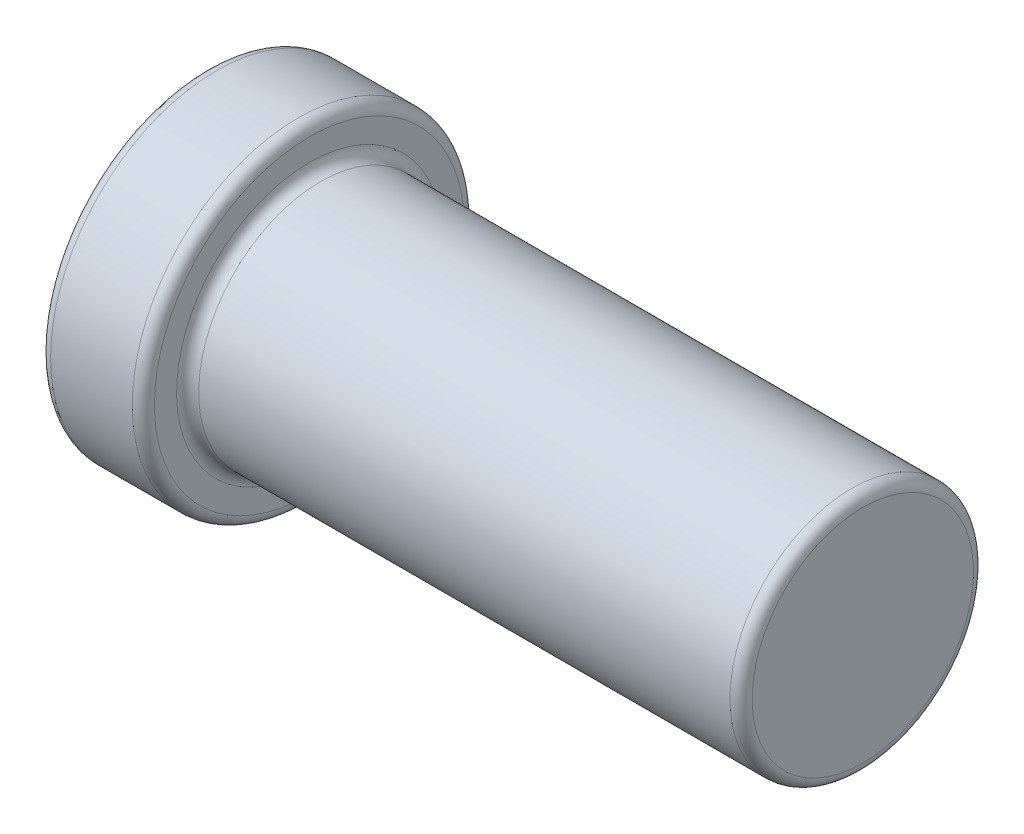
ISO-10303-21;
HEADER;
FILE_DESCRIPTION(('STEP AP214'),'2;1');
FILE_NAME('part.step','',(''),(''),'','','');
FILE_SCHEMA(('AUTOMOTIVE_DESIGN { 1 0 10303 214 1 1 1 1 }'));
ENDSEC;
DATA;
#1=APPLICATION_CONTEXT('core data for automotive mechanical design processes');
#2=APPLICATION_PROTOCOL_DEFINITION('international standard','automotive_design',2000,#1);
#3=PRODUCT_CONTEXT('',#1,'mechanical');
#4=PRODUCT('Part','Part','',(#3));
#5=PRODUCT_RELATED_PRODUCT_CATEGORY('part','',(#4));
#6=PRODUCT_DEFINITION_FORMATION('','',#4);
#7=PRODUCT_DEFINITION_CONTEXT('part definition',#1,'design');
#8=PRODUCT_DEFINITION('design','',#6,#7);
#9=PRODUCT_DEFINITION_SHAPE('','',#8);
#10=(LENGTH_UNIT() NAMED_UNIT(*) SI_UNIT(.MILLI.,.METRE.));
#11=(NAMED_UNIT(*) PLANE_ANGLE_UNIT() SI_UNIT($,.RADIAN.));
#12=(NAMED_UNIT(*) SI_UNIT($,.STERADIAN.) SOLID_ANGLE_UNIT());
#13=UNCERTAINTY_MEASURE_WITH_UNIT(LENGTH_MEASURE(1.E-05),#10,'distance_accuracy_value','');
#14=(GEOMETRIC_REPRESENTATION_CONTEXT(3) GLOBAL_UNCERTAINTY_ASSIGNED_CONTEXT((#13)) GLOBAL_UNIT_ASSIGNED_CONTEXT((#10,
#11,#12)) REPRESENTATION_CONTEXT('',''));
#15=CARTESIAN_POINT('',(0.,0.,0.));
#16=DIRECTION('',(0.,0.,1.));
#17=DIRECTION('',(1.,0.,0.));
#18=AXIS2_PLACEMENT_3D('',#15,#16,#17);
#19=CARTESIAN_POINT('',(0.,0.,0.));
#20=DIRECTION('',(-1.,0.,0.));
#21=DIRECTION('',(0.,-1.,0.));
#22=AXIS2_PLACEMENT_3D('',#19,#20,#21);
#23=CONICAL_SURFACE('',#22,1.5,1.10714871779409);
#24=CARTESIAN_POINT('',(0.489442719099992,0.,0.));
#25=DIRECTION('',(-1.,0.,0.));
#26=DIRECTION('',(0.,-1.,0.));
#27=AXIS2_PLACEMENT_3D('',#24,#25,#26);
#28=CIRCLE('',#27,0.521114561800017);
#29=CARTESIAN_POINT('',(0.489442719099992,-0.521114561800017,0.));
#30=VERTEX_POINT('',#29);
#31=EDGE_CURVE('E38',#30,#30,#28,.F.);
#32=ORIENTED_EDGE('',*,*,#31,.T.);
#33=EDGE_LOOP('',(#32));
#34=FACE_BOUND('',#33,.T.);
#35=CARTESIAN_POINT('',(0.0723606797749982,0.,0.));
#36=DIRECTION('',(1.,0.,0.));
#37=DIRECTION('',(0.,1.,0.));
#38=AXIS2_PLACEMENT_3D('',#35,#36,#37);
#39=CIRCLE('',#38,1.35527864045);
#40=CARTESIAN_POINT('',(0.0723606797749981,1.35527864045,0.));
#41=VERTEX_POINT('',#40);
#42=EDGE_CURVE('E42',#41,#41,#39,.F.);
#43=ORIENTED_EDGE('',*,*,#42,.T.);
#44=EDGE_LOOP('',(#43));
#45=FACE_BOUND('',#44,.T.);
#46=ADVANCED_FACE('F31',(#34,#45),#23,.F.);
#47=CARTESIAN_POINT('',(6.,0.,0.));
#48=DIRECTION('',(1.,0.,0.));
#49=DIRECTION('',(0.,1.,0.));
#50=AXIS2_PLACEMENT_3D('',#47,#48,#49);
#51=CYLINDRICAL_SURFACE('',#50,1.5);
#52=CARTESIAN_POINT('',(0.9,0.,0.));
#53=DIRECTION('',(1.,0.,0.));
#54=DIRECTION('',(0.,1.,0.));
#55=AXIS2_PLACEMENT_3D('',#52,#53,#54);
#56=CIRCLE('',#55,1.5);
#57=CARTESIAN_POINT('',(0.9,1.5,0.));
#58=VERTEX_POINT('',#57);
#59=EDGE_CURVE('E46',#58,#58,#56,.F.);
#60=ORIENTED_EDGE('',*,*,#59,.T.);
#61=EDGE_LOOP('',(#60));
#62=FACE_BOUND('',#61,.T.);
#63=CARTESIAN_POINT('',(0.16180339887499,0.,0.));
#64=DIRECTION('',(-1.,0.,0.));
#65=DIRECTION('',(0.,-1.,0.));
#66=AXIS2_PLACEMENT_3D('',#63,#64,#65);
#67=CIRCLE('',#66,1.5);
#68=CARTESIAN_POINT('',(0.16180339887499,-1.5,0.));
#69=VERTEX_POINT('',#68);
#70=EDGE_CURVE('E51',#69,#69,#67,.F.);
#71=ORIENTED_EDGE('',*,*,#70,.T.);
#72=EDGE_LOOP('',(#71));
#73=FACE_BOUND('',#72,.T.);
#74=ADVANCED_FACE('F90',(#62,#73),#51,.T.);
#75=CARTESIAN_POINT('',(1.,1.5,0.));
#76=DIRECTION('',(1.,0.,0.));
#77=DIRECTION('',(0.,1.,0.));
#78=AXIS2_PLACEMENT_3D('',#75,#76,#77);
#79=PLANE('',#78);
#80=CARTESIAN_POINT('',(1.,0.,0.));
#81=DIRECTION('',(1.,0.,0.));
#82=DIRECTION('',(0.,1.,0.));
#83=AXIS2_PLACEMENT_3D('',#80,#81,#82);
#84=CIRCLE('',#83,1.2);
#85=CARTESIAN_POINT('',(1.,1.2,0.));
#86=VERTEX_POINT('',#85);
#87=EDGE_CURVE('E54',#86,#86,#84,.F.);
#88=ORIENTED_EDGE('',*,*,#87,.T.);
#89=EDGE_LOOP('',(#88));
#90=FACE_BOUND('',#89,.T.);
#91=CARTESIAN_POINT('',(1.,0.,0.));
#92=DIRECTION('',(1.,0.,0.));
#93=DIRECTION('',(0.,1.,0.));
#94=AXIS2_PLACEMENT_3D('',#91,#92,#93);
#95=CIRCLE('',#94,1.4);
#96=CARTESIAN_POINT('',(1.,1.4,0.));
#97=VERTEX_POINT('',#96);
#98=EDGE_CURVE('E57',#97,#97,#95,.T.);
#99=ORIENTED_EDGE('',*,*,#98,.T.);
#100=EDGE_LOOP('',(#99));
#101=FACE_BOUND('',#100,.T.);
#102=ADVANCED_FACE('F94',(#90,#101),#79,.T.);
#103=CARTESIAN_POINT('',(6.,0.,0.));
#104=DIRECTION('',(1.,0.,0.));
#105=DIRECTION('',(0.,1.,0.));
#106=AXIS2_PLACEMENT_3D('',#103,#104,#105);
#107=CYLINDRICAL_SURFACE('',#106,1.1);
#108=CARTESIAN_POINT('',(1.1,0.,0.));
#109=DIRECTION('',(1.,0.,0.));
#110=DIRECTION('',(0.,1.,0.));
#111=AXIS2_PLACEMENT_3D('',#108,#109,#110);
#112=CIRCLE('',#111,1.1);
#113=CARTESIAN_POINT('',(1.1,1.1,0.));
#114=VERTEX_POINT('',#113);
#115=EDGE_CURVE('E60',#114,#114,#112,.T.);
#116=ORIENTED_EDGE('',*,*,#115,.T.);
#117=EDGE_LOOP('',(#116));
#118=FACE_BOUND('',#117,.T.);
#119=CARTESIAN_POINT('',(5.9,0.,0.));
#120=DIRECTION('',(1.,0.,0.));
#121=DIRECTION('',(0.,1.,0.));
#122=AXIS2_PLACEMENT_3D('',#119,#120,#121);
#123=CIRCLE('',#122,1.1);
#124=CARTESIAN_POINT('',(5.9,1.1,0.));
#125=VERTEX_POINT('',#124);
#126=EDGE_CURVE('E63',#125,#125,#123,.F.);
#127=ORIENTED_EDGE('',*,*,#126,.T.);
#128=EDGE_LOOP('',(#127));
#129=FACE_BOUND('',#128,.T.);
#130=ADVANCED_FACE('F101',(#118,#129),#107,.T.);
#131=CARTESIAN_POINT('',(6.,1.1,0.));
#132=DIRECTION('',(1.,0.,0.));
#133=DIRECTION('',(0.,1.,0.));
#134=AXIS2_PLACEMENT_3D('',#131,#132,#133);
#135=PLANE('',#134);
#136=CARTESIAN_POINT('',(6.,0.,0.));
#137=DIRECTION('',(1.,0.,0.));
#138=DIRECTION('',(0.,1.,0.));
#139=AXIS2_PLACEMENT_3D('',#136,#137,#138);
#140=CIRCLE('',#139,1.);
#141=CARTESIAN_POINT('',(6.,1.,0.));
#142=VERTEX_POINT('',#141);
#143=EDGE_CURVE('E66',#142,#142,#140,.T.);
#144=ORIENTED_EDGE('',*,*,#143,.T.);
#145=EDGE_LOOP('',(#144));
#146=FACE_BOUND('',#145,.T.);
#147=ADVANCED_FACE('F70',(#146),#135,.T.);
#148=CARTESIAN_POINT('',(0.5,0.,0.));
#149=DIRECTION('',(-1.,0.,0.));
#150=DIRECTION('',(0.,-1.,0.));
#151=AXIS2_PLACEMENT_3D('',#148,#149,#150);
#152=PLANE('',#151);
#153=CARTESIAN_POINT('',(0.5,0.,0.));
#154=DIRECTION('',(-1.,0.,0.));
#155=DIRECTION('',(0.,-1.,0.));
#156=AXIS2_PLACEMENT_3D('',#153,#154,#155);
#157=CIRCLE('',#156,0.476393202250021);
#158=CARTESIAN_POINT('',(0.5,-0.476393202250021,0.));
#159=VERTEX_POINT('',#158);
#160=EDGE_CURVE('E10',#159,#159,#157,.T.);
#161=ORIENTED_EDGE('',*,*,#160,.T.);
#162=EDGE_LOOP('',(#161));
#163=FACE_BOUND('',#162,.T.);
#164=ADVANCED_FACE('F75',(#163),#152,.T.);
#165=CARTESIAN_POINT('',(5.9,0.,0.));
#166=DIRECTION('',(1.,0.,0.));
#167=DIRECTION('',(0.,1.,0.));
#168=AXIS2_PLACEMENT_3D('',#165,#166,#167);
#169=TOROIDAL_SURFACE('',#168,1.,0.1);
#170=ORIENTED_EDGE('',*,*,#126,.F.);
#171=EDGE_LOOP('',(#170));
#172=FACE_BOUND('',#171,.T.);
#173=ORIENTED_EDGE('',*,*,#143,.F.);
#174=EDGE_LOOP('',(#173));
#175=FACE_BOUND('',#174,.T.);
#176=ADVANCED_FACE('F72',(#172,#175),#169,.T.);
#177=CARTESIAN_POINT('',(1.1,0.,0.));
#178=DIRECTION('',(1.,0.,0.));
#179=DIRECTION('',(0.,1.,0.));
#180=AXIS2_PLACEMENT_3D('',#177,#178,#179);
#181=TOROIDAL_SURFACE('',#180,1.2,0.1);
#182=ORIENTED_EDGE('',*,*,#87,.F.);
#183=EDGE_LOOP('',(#182));
#184=FACE_BOUND('',#183,.T.);
#185=ORIENTED_EDGE('',*,*,#115,.F.);
#186=EDGE_LOOP('',(#185));
#187=FACE_BOUND('',#186,.T.);
#188=ADVANCED_FACE('F74',(#184,#187),#181,.F.);
#189=CARTESIAN_POINT('',(0.9,0.,0.));
#190=DIRECTION('',(1.,0.,0.));
#191=DIRECTION('',(0.,1.,0.));
#192=AXIS2_PLACEMENT_3D('',#189,#190,#191);
#193=TOROIDAL_SURFACE('',#192,1.4,0.1);
#194=ORIENTED_EDGE('',*,*,#59,.F.);
#195=EDGE_LOOP('',(#194));
#196=FACE_BOUND('',#195,.T.);
#197=ORIENTED_EDGE('',*,*,#98,.F.);
#198=EDGE_LOOP('',(#197));
#199=FACE_BOUND('',#198,.T.);
#200=ADVANCED_FACE('F82',(#196,#199),#193,.T.);
#201=CARTESIAN_POINT('',(0.4,0.,0.));
#202=DIRECTION('',(-1.,0.,0.));
#203=DIRECTION('',(0.,-1.,0.));
#204=AXIS2_PLACEMENT_3D('',#201,#202,#203);
#205=TOROIDAL_SURFACE('',#204,0.476393202250021,0.1);
#206=ORIENTED_EDGE('',*,*,#160,.F.);
#207=EDGE_LOOP('',(#206));
#208=FACE_BOUND('',#207,.T.);
#209=ORIENTED_EDGE('',*,*,#31,.F.);
#210=EDGE_LOOP('',(#209));
#211=FACE_BOUND('',#210,.T.);
#212=ADVANCED_FACE('F133',(#208,#211),#205,.F.);
#213=CARTESIAN_POINT('',(0.16180339887499,0.,0.));
#214=DIRECTION('',(-1.,0.,0.));
#215=DIRECTION('',(0.,-1.,0.));
#216=AXIS2_PLACEMENT_3D('',#213,#214,#215);
#217=TOROIDAL_SURFACE('',#216,1.4,0.1);
#218=ORIENTED_EDGE('',*,*,#42,.F.);
#219=EDGE_LOOP('',(#218));
#220=FACE_BOUND('',#219,.T.);
#221=ORIENTED_EDGE('',*,*,#70,.F.);
#222=EDGE_LOOP('',(#221));
#223=FACE_BOUND('',#222,.T.);
#224=ADVANCED_FACE('F33',(#220,#223),#217,.T.);
#225=CLOSED_SHELL('',(#46,#74,#102,#130,#147,#164,#176,#188,#200,#212,#224));
#226=MANIFOLD_SOLID_BREP('B2',#225);
#227=ADVANCED_BREP_SHAPE_REPRESENTATION('',(#18,#226),#14);
#228=SHAPE_DEFINITION_REPRESENTATION(#9,#227);
ENDSEC;
END-ISO-10303-21;
